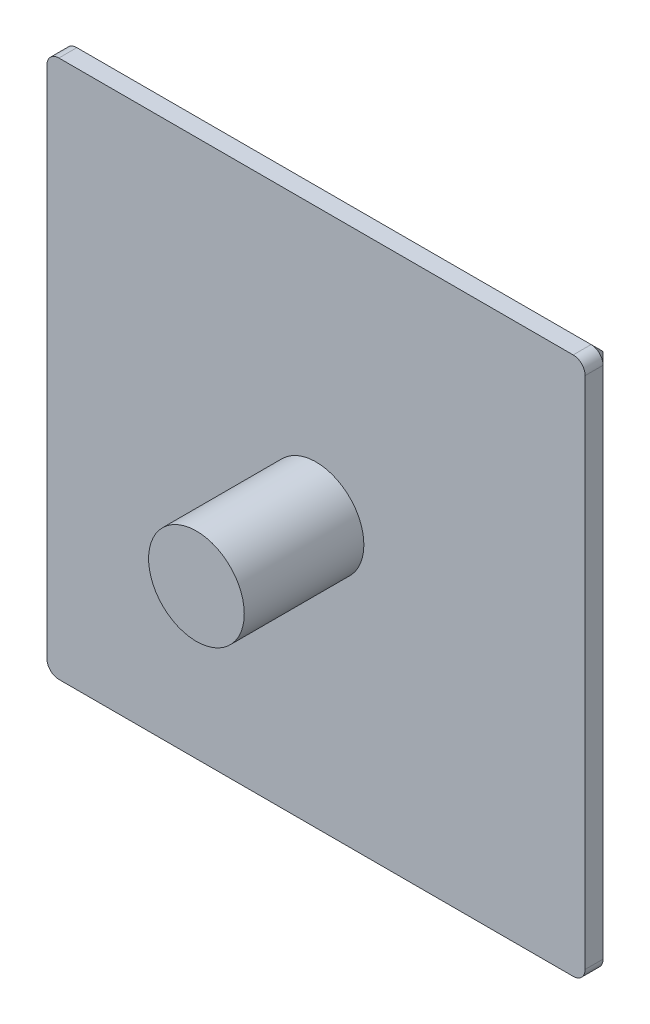
ISO-10303-21;
HEADER;
FILE_DESCRIPTION(('STEP AP214'),'2;1');
FILE_NAME('part.step','',(''),(''),'','','');
FILE_SCHEMA(('AUTOMOTIVE_DESIGN { 1 0 10303 214 1 1 1 1 }'));
ENDSEC;
DATA;
#1=APPLICATION_CONTEXT('core data for automotive mechanical design processes');
#2=APPLICATION_PROTOCOL_DEFINITION('international standard','automotive_design',2000,#1);
#3=PRODUCT_CONTEXT('',#1,'mechanical');
#4=PRODUCT('Part','Part','',(#3));
#5=PRODUCT_RELATED_PRODUCT_CATEGORY('part','',(#4));
#6=PRODUCT_DEFINITION_FORMATION('','',#4);
#7=PRODUCT_DEFINITION_CONTEXT('part definition',#1,'design');
#8=PRODUCT_DEFINITION('design','',#6,#7);
#9=PRODUCT_DEFINITION_SHAPE('','',#8);
#10=(LENGTH_UNIT() NAMED_UNIT(*) SI_UNIT(.MILLI.,.METRE.));
#11=(NAMED_UNIT(*) PLANE_ANGLE_UNIT() SI_UNIT($,.RADIAN.));
#12=(NAMED_UNIT(*) SI_UNIT($,.STERADIAN.) SOLID_ANGLE_UNIT());
#13=UNCERTAINTY_MEASURE_WITH_UNIT(LENGTH_MEASURE(1.E-05),#10,'distance_accuracy_value','');
#14=(GEOMETRIC_REPRESENTATION_CONTEXT(3) GLOBAL_UNCERTAINTY_ASSIGNED_CONTEXT((#13)) GLOBAL_UNIT_ASSIGNED_CONTEXT((#10,
#11,#12)) REPRESENTATION_CONTEXT('',''));
#15=CARTESIAN_POINT('',(0.,0.,0.));
#16=DIRECTION('',(0.,0.,1.));
#17=DIRECTION('',(1.,0.,0.));
#18=AXIS2_PLACEMENT_3D('',#15,#16,#17);
#19=CARTESIAN_POINT('',(-22.5,-22.5,2.5));
#20=DIRECTION('',(1.,0.,0.));
#21=DIRECTION('',(0.,0.,-1.));
#22=AXIS2_PLACEMENT_3D('',#19,#20,#21);
#23=PLANE('',#22);
#24=DIRECTION('',(0.,0.,-1.));
#25=VECTOR('',#24,1.);
#26=CARTESIAN_POINT('',(-22.5,21.5,2.5));
#27=LINE('',#26,#25);
#28=CARTESIAN_POINT('',(-22.5,21.5,2.5));
#29=VERTEX_POINT('',#28);
#30=CARTESIAN_POINT('',(-22.5,21.5,1.));
#31=VERTEX_POINT('',#30);
#32=EDGE_CURVE('E131',#29,#31,#27,.T.);
#33=ORIENTED_EDGE('',*,*,#32,.T.);
#34=DIRECTION('',(0.,-1.,0.));
#35=VECTOR('',#34,1.);
#36=CARTESIAN_POINT('',(-22.5,-22.5,1.));
#37=LINE('',#36,#35);
#38=CARTESIAN_POINT('',(-22.5,-21.5,1.));
#39=VERTEX_POINT('',#38);
#40=EDGE_CURVE('E56',#31,#39,#37,.T.);
#41=ORIENTED_EDGE('',*,*,#40,.T.);
#42=DIRECTION('',(0.,0.,-1.));
#43=VECTOR('',#42,1.);
#44=CARTESIAN_POINT('',(-22.5,-21.5,2.5));
#45=LINE('',#44,#43);
#46=CARTESIAN_POINT('',(-22.5,-21.5,2.5));
#47=VERTEX_POINT('',#46);
#48=EDGE_CURVE('E133',#39,#47,#45,.F.);
#49=ORIENTED_EDGE('',*,*,#48,.T.);
#50=DIRECTION('',(0.,-1.,0.));
#51=VECTOR('',#50,1.);
#52=CARTESIAN_POINT('',(-22.5,-22.5,2.5));
#53=LINE('',#52,#51);
#54=EDGE_CURVE('E118',#29,#47,#53,.T.);
#55=ORIENTED_EDGE('',*,*,#54,.F.);
#56=EDGE_LOOP('',(#33,#41,#49,#55));
#57=FACE_BOUND('',#56,.T.);
#58=ADVANCED_FACE('F32',(#57),#23,.F.);
#59=CARTESIAN_POINT('',(22.5,-22.5,2.5));
#60=DIRECTION('',(0.,1.,0.));
#61=DIRECTION('',(-1.,0.,0.));
#62=AXIS2_PLACEMENT_3D('',#59,#60,#61);
#63=PLANE('',#62);
#64=DIRECTION('',(0.,0.,-1.));
#65=VECTOR('',#64,1.);
#66=CARTESIAN_POINT('',(-21.5,-22.5,2.5));
#67=LINE('',#66,#65);
#68=CARTESIAN_POINT('',(-21.5,-22.5,2.5));
#69=VERTEX_POINT('',#68);
#70=CARTESIAN_POINT('',(-21.5,-22.5,1.));
#71=VERTEX_POINT('',#70);
#72=EDGE_CURVE('E124',#69,#71,#67,.T.);
#73=ORIENTED_EDGE('',*,*,#72,.T.);
#74=DIRECTION('',(1.,0.,0.));
#75=VECTOR('',#74,1.);
#76=CARTESIAN_POINT('',(22.5,-22.5,1.));
#77=LINE('',#76,#75);
#78=CARTESIAN_POINT('',(21.5,-22.5,1.));
#79=VERTEX_POINT('',#78);
#80=EDGE_CURVE('E11',#71,#79,#77,.T.);
#81=ORIENTED_EDGE('',*,*,#80,.T.);
#82=DIRECTION('',(0.,0.,-1.));
#83=VECTOR('',#82,1.);
#84=CARTESIAN_POINT('',(21.5,-22.5,2.5));
#85=LINE('',#84,#83);
#86=CARTESIAN_POINT('',(21.5,-22.5,2.5));
#87=VERTEX_POINT('',#86);
#88=EDGE_CURVE('E127',#79,#87,#85,.F.);
#89=ORIENTED_EDGE('',*,*,#88,.T.);
#90=DIRECTION('',(1.,0.,0.));
#91=VECTOR('',#90,1.);
#92=CARTESIAN_POINT('',(22.5,-22.5,2.5));
#93=LINE('',#92,#91);
#94=EDGE_CURVE('E115',#69,#87,#93,.T.);
#95=ORIENTED_EDGE('',*,*,#94,.F.);
#96=EDGE_LOOP('',(#73,#81,#89,#95));
#97=FACE_BOUND('',#96,.T.);
#98=ADVANCED_FACE('F123',(#97),#63,.F.);
#99=CARTESIAN_POINT('',(22.5,-22.5,2.5));
#100=DIRECTION('',(-1.,0.,0.));
#101=DIRECTION('',(0.,0.,1.));
#102=AXIS2_PLACEMENT_3D('',#99,#100,#101);
#103=PLANE('',#102);
#104=DIRECTION('',(0.,0.,-1.));
#105=VECTOR('',#104,1.);
#106=CARTESIAN_POINT('',(22.5,-21.5,2.5));
#107=LINE('',#106,#105);
#108=CARTESIAN_POINT('',(22.5,-21.5,2.5));
#109=VERTEX_POINT('',#108);
#110=CARTESIAN_POINT('',(22.5,-21.5,1.));
#111=VERTEX_POINT('',#110);
#112=EDGE_CURVE('E146',#109,#111,#107,.T.);
#113=ORIENTED_EDGE('',*,*,#112,.T.);
#114=DIRECTION('',(0.,1.,0.));
#115=VECTOR('',#114,1.);
#116=CARTESIAN_POINT('',(22.5,-22.5,1.));
#117=LINE('',#116,#115);
#118=CARTESIAN_POINT('',(22.5,21.5,1.));
#119=VERTEX_POINT('',#118);
#120=EDGE_CURVE('E157',#111,#119,#117,.T.);
#121=ORIENTED_EDGE('',*,*,#120,.T.);
#122=DIRECTION('',(0.,0.,-1.));
#123=VECTOR('',#122,1.);
#124=CARTESIAN_POINT('',(22.5,21.5,2.5));
#125=LINE('',#124,#123);
#126=CARTESIAN_POINT('',(22.5,21.5,2.5));
#127=VERTEX_POINT('',#126);
#128=EDGE_CURVE('E119',#119,#127,#125,.F.);
#129=ORIENTED_EDGE('',*,*,#128,.T.);
#130=DIRECTION('',(0.,1.,0.));
#131=VECTOR('',#130,1.);
#132=CARTESIAN_POINT('',(22.5,-22.5,2.5));
#133=LINE('',#132,#131);
#134=EDGE_CURVE('E128',#109,#127,#133,.T.);
#135=ORIENTED_EDGE('',*,*,#134,.F.);
#136=EDGE_LOOP('',(#113,#121,#129,#135));
#137=FACE_BOUND('',#136,.T.);
#138=ADVANCED_FACE('F247',(#137),#103,.F.);
#139=CARTESIAN_POINT('',(22.5,22.5,2.5));
#140=DIRECTION('',(0.,-1.,0.));
#141=DIRECTION('',(1.,0.,0.));
#142=AXIS2_PLACEMENT_3D('',#139,#140,#141);
#143=PLANE('',#142);
#144=DIRECTION('',(0.,0.,-1.));
#145=VECTOR('',#144,1.);
#146=CARTESIAN_POINT('',(21.5,22.5,2.5));
#147=LINE('',#146,#145);
#148=CARTESIAN_POINT('',(21.5,22.5,2.5));
#149=VERTEX_POINT('',#148);
#150=CARTESIAN_POINT('',(21.5,22.5,1.));
#151=VERTEX_POINT('',#150);
#152=EDGE_CURVE('E149',#149,#151,#147,.T.);
#153=ORIENTED_EDGE('',*,*,#152,.T.);
#154=DIRECTION('',(-1.,0.,0.));
#155=VECTOR('',#154,1.);
#156=CARTESIAN_POINT('',(22.5,22.5,1.));
#157=LINE('',#156,#155);
#158=CARTESIAN_POINT('',(-21.5,22.5,1.));
#159=VERTEX_POINT('',#158);
#160=EDGE_CURVE('E170',#151,#159,#157,.T.);
#161=ORIENTED_EDGE('',*,*,#160,.T.);
#162=DIRECTION('',(0.,0.,-1.));
#163=VECTOR('',#162,1.);
#164=CARTESIAN_POINT('',(-21.5,22.5,2.5));
#165=LINE('',#164,#163);
#166=CARTESIAN_POINT('',(-21.5,22.5,2.5));
#167=VERTEX_POINT('',#166);
#168=EDGE_CURVE('E152',#159,#167,#165,.F.);
#169=ORIENTED_EDGE('',*,*,#168,.T.);
#170=DIRECTION('',(-1.,0.,0.));
#171=VECTOR('',#170,1.);
#172=CARTESIAN_POINT('',(22.5,22.5,2.5));
#173=LINE('',#172,#171);
#174=EDGE_CURVE('E135',#149,#167,#173,.T.);
#175=ORIENTED_EDGE('',*,*,#174,.F.);
#176=EDGE_LOOP('',(#153,#161,#169,#175));
#177=FACE_BOUND('',#176,.T.);
#178=ADVANCED_FACE('F256',(#177),#143,.F.);
#179=CARTESIAN_POINT('',(0.,0.,2.5));
#180=DIRECTION('',(0.,0.,1.));
#181=DIRECTION('',(1.,0.,0.));
#182=AXIS2_PLACEMENT_3D('',#179,#180,#181);
#183=PLANE('',#182);
#184=CARTESIAN_POINT('',(0.,0.,2.5));
#185=DIRECTION('',(0.,0.,1.));
#186=DIRECTION('',(1.,0.,0.));
#187=AXIS2_PLACEMENT_3D('',#184,#185,#186);
#188=CIRCLE('',#187,4.);
#189=CARTESIAN_POINT('',(4.,0.,2.5));
#190=VERTEX_POINT('',#189);
#191=EDGE_CURVE('E198',#190,#190,#188,.T.);
#192=ORIENTED_EDGE('',*,*,#191,.F.);
#193=EDGE_LOOP('',(#192));
#194=FACE_BOUND('',#193,.T.);
#195=ORIENTED_EDGE('',*,*,#54,.T.);
#196=CARTESIAN_POINT('',(-21.5,-21.5,2.5));
#197=DIRECTION('',(0.,0.,1.));
#198=DIRECTION('',(1.,0.,0.));
#199=AXIS2_PLACEMENT_3D('',#196,#197,#198);
#200=CIRCLE('',#199,1.);
#201=EDGE_CURVE('E112',#47,#69,#200,.T.);
#202=ORIENTED_EDGE('',*,*,#201,.T.);
#203=ORIENTED_EDGE('',*,*,#94,.T.);
#204=CARTESIAN_POINT('',(21.5,-21.5,2.5));
#205=DIRECTION('',(0.,0.,1.));
#206=DIRECTION('',(1.,0.,0.));
#207=AXIS2_PLACEMENT_3D('',#204,#205,#206);
#208=CIRCLE('',#207,1.);
#209=EDGE_CURVE('E120',#87,#109,#208,.T.);
#210=ORIENTED_EDGE('',*,*,#209,.T.);
#211=ORIENTED_EDGE('',*,*,#134,.T.);
#212=CARTESIAN_POINT('',(21.5,21.5,2.5));
#213=DIRECTION('',(0.,0.,1.));
#214=DIRECTION('',(1.,0.,0.));
#215=AXIS2_PLACEMENT_3D('',#212,#213,#214);
#216=CIRCLE('',#215,1.);
#217=EDGE_CURVE('E140',#127,#149,#216,.T.);
#218=ORIENTED_EDGE('',*,*,#217,.T.);
#219=ORIENTED_EDGE('',*,*,#174,.T.);
#220=CARTESIAN_POINT('',(-21.5,21.5,2.5));
#221=DIRECTION('',(0.,0.,1.));
#222=DIRECTION('',(1.,0.,0.));
#223=AXIS2_PLACEMENT_3D('',#220,#221,#222);
#224=CIRCLE('',#223,1.);
#225=EDGE_CURVE('E142',#167,#29,#224,.T.);
#226=ORIENTED_EDGE('',*,*,#225,.T.);
#227=EDGE_LOOP('',(#195,#202,#203,#210,#211,#218,#219,#226));
#228=FACE_BOUND('',#227,.T.);
#229=ADVANCED_FACE('F114',(#194,#228),#183,.T.);
#230=CARTESIAN_POINT('',(0.,0.,0.));
#231=DIRECTION('',(0.,0.,1.));
#232=DIRECTION('',(1.,0.,0.));
#233=AXIS2_PLACEMENT_3D('',#230,#231,#232);
#234=PLANE('',#233);
#235=DIRECTION('',(1.,0.,0.));
#236=VECTOR('',#235,1.);
#237=CARTESIAN_POINT('',(0.,21.5,0.));
#238=LINE('',#237,#236);
#239=CARTESIAN_POINT('',(-21.5,21.5,0.));
#240=VERTEX_POINT('',#239);
#241=CARTESIAN_POINT('',(21.5,21.5,0.));
#242=VERTEX_POINT('',#241);
#243=EDGE_CURVE('E163',#240,#242,#238,.T.);
#244=ORIENTED_EDGE('',*,*,#243,.T.);
#245=DIRECTION('',(0.,-1.,0.));
#246=VECTOR('',#245,1.);
#247=CARTESIAN_POINT('',(21.5,0.,0.));
#248=LINE('',#247,#246);
#249=CARTESIAN_POINT('',(21.5,-21.5,0.));
#250=VERTEX_POINT('',#249);
#251=EDGE_CURVE('E165',#242,#250,#248,.T.);
#252=ORIENTED_EDGE('',*,*,#251,.T.);
#253=DIRECTION('',(-1.,0.,0.));
#254=VECTOR('',#253,1.);
#255=CARTESIAN_POINT('',(0.,-21.5,0.));
#256=LINE('',#255,#254);
#257=CARTESIAN_POINT('',(-21.5,-21.5,0.));
#258=VERTEX_POINT('',#257);
#259=EDGE_CURVE('E159',#250,#258,#256,.T.);
#260=ORIENTED_EDGE('',*,*,#259,.T.);
#261=DIRECTION('',(0.,1.,0.));
#262=VECTOR('',#261,1.);
#263=CARTESIAN_POINT('',(-21.5,0.,0.));
#264=LINE('',#263,#262);
#265=EDGE_CURVE('E161',#258,#240,#264,.T.);
#266=ORIENTED_EDGE('',*,*,#265,.T.);
#267=EDGE_LOOP('',(#244,#252,#260,#266));
#268=FACE_BOUND('',#267,.T.);
#269=ADVANCED_FACE('F263',(#268),#234,.F.);
#270=CARTESIAN_POINT('',(-21.5,-21.5,2.5));
#271=DIRECTION('',(0.,0.,-1.));
#272=DIRECTION('',(-1.,0.,0.));
#273=AXIS2_PLACEMENT_3D('',#270,#271,#272);
#274=CYLINDRICAL_SURFACE('',#273,1.);
#275=ORIENTED_EDGE('',*,*,#48,.F.);
#276=CARTESIAN_POINT('',(-21.5,-21.5,1.));
#277=DIRECTION('',(0.,0.,1.));
#278=DIRECTION('',(1.,0.,0.));
#279=AXIS2_PLACEMENT_3D('',#276,#277,#278);
#280=CIRCLE('',#279,1.);
#281=EDGE_CURVE('E41',#39,#71,#280,.T.);
#282=ORIENTED_EDGE('',*,*,#281,.T.);
#283=ORIENTED_EDGE('',*,*,#72,.F.);
#284=ORIENTED_EDGE('',*,*,#201,.F.);
#285=EDGE_LOOP('',(#275,#282,#283,#284));
#286=FACE_BOUND('',#285,.T.);
#287=ADVANCED_FACE('F130',(#286),#274,.T.);
#288=CARTESIAN_POINT('',(21.5,-21.5,2.5));
#289=DIRECTION('',(0.,0.,-1.));
#290=DIRECTION('',(-1.,0.,0.));
#291=AXIS2_PLACEMENT_3D('',#288,#289,#290);
#292=CYLINDRICAL_SURFACE('',#291,1.);
#293=ORIENTED_EDGE('',*,*,#88,.F.);
#294=CARTESIAN_POINT('',(21.5,-21.5,1.));
#295=DIRECTION('',(0.,0.,1.));
#296=DIRECTION('',(1.,0.,0.));
#297=AXIS2_PLACEMENT_3D('',#294,#295,#296);
#298=CIRCLE('',#297,1.);
#299=EDGE_CURVE('E154',#79,#111,#298,.T.);
#300=ORIENTED_EDGE('',*,*,#299,.T.);
#301=ORIENTED_EDGE('',*,*,#112,.F.);
#302=ORIENTED_EDGE('',*,*,#209,.F.);
#303=EDGE_LOOP('',(#293,#300,#301,#302));
#304=FACE_BOUND('',#303,.T.);
#305=ADVANCED_FACE('F235',(#304),#292,.T.);
#306=CARTESIAN_POINT('',(-21.5,21.5,2.5));
#307=DIRECTION('',(0.,0.,-1.));
#308=DIRECTION('',(-1.,0.,0.));
#309=AXIS2_PLACEMENT_3D('',#306,#307,#308);
#310=CYLINDRICAL_SURFACE('',#309,1.);
#311=ORIENTED_EDGE('',*,*,#168,.F.);
#312=CARTESIAN_POINT('',(-21.5,21.5,1.));
#313=DIRECTION('',(0.,0.,1.));
#314=DIRECTION('',(1.,0.,0.));
#315=AXIS2_PLACEMENT_3D('',#312,#313,#314);
#316=CIRCLE('',#315,1.);
#317=EDGE_CURVE('E172',#159,#31,#316,.T.);
#318=ORIENTED_EDGE('',*,*,#317,.T.);
#319=ORIENTED_EDGE('',*,*,#32,.F.);
#320=ORIENTED_EDGE('',*,*,#225,.F.);
#321=EDGE_LOOP('',(#311,#318,#319,#320));
#322=FACE_BOUND('',#321,.T.);
#323=ADVANCED_FACE('F221',(#322),#310,.T.);
#324=CARTESIAN_POINT('',(21.5,21.5,2.5));
#325=DIRECTION('',(0.,0.,-1.));
#326=DIRECTION('',(-1.,0.,0.));
#327=AXIS2_PLACEMENT_3D('',#324,#325,#326);
#328=CYLINDRICAL_SURFACE('',#327,1.);
#329=ORIENTED_EDGE('',*,*,#128,.F.);
#330=CARTESIAN_POINT('',(21.5,21.5,1.));
#331=DIRECTION('',(0.,0.,1.));
#332=DIRECTION('',(1.,0.,0.));
#333=AXIS2_PLACEMENT_3D('',#330,#331,#332);
#334=CIRCLE('',#333,1.);
#335=EDGE_CURVE('E168',#119,#151,#334,.T.);
#336=ORIENTED_EDGE('',*,*,#335,.T.);
#337=ORIENTED_EDGE('',*,*,#152,.F.);
#338=ORIENTED_EDGE('',*,*,#217,.F.);
#339=EDGE_LOOP('',(#329,#336,#337,#338));
#340=FACE_BOUND('',#339,.T.);
#341=ADVANCED_FACE('F251',(#340),#328,.T.);
#342=CARTESIAN_POINT('',(0.,0.,12.5));
#343=DIRECTION('',(0.,0.,-1.));
#344=DIRECTION('',(-1.,0.,0.));
#345=AXIS2_PLACEMENT_3D('',#342,#343,#344);
#346=CYLINDRICAL_SURFACE('',#345,4.);
#347=CARTESIAN_POINT('',(0.,0.,12.5));
#348=DIRECTION('',(0.,0.,1.));
#349=DIRECTION('',(1.,0.,0.));
#350=AXIS2_PLACEMENT_3D('',#347,#348,#349);
#351=CIRCLE('',#350,4.);
#352=CARTESIAN_POINT('',(4.,0.,12.5));
#353=VERTEX_POINT('',#352);
#354=EDGE_CURVE('E203',#353,#353,#351,.T.);
#355=ORIENTED_EDGE('',*,*,#354,.F.);
#356=EDGE_LOOP('',(#355));
#357=FACE_BOUND('',#356,.T.);
#358=ORIENTED_EDGE('',*,*,#191,.T.);
#359=EDGE_LOOP('',(#358));
#360=FACE_BOUND('',#359,.T.);
#361=ADVANCED_FACE('F283',(#357,#360),#346,.T.);
#362=CARTESIAN_POINT('',(0.,0.,12.5));
#363=DIRECTION('',(0.,0.,1.));
#364=DIRECTION('',(1.,0.,0.));
#365=AXIS2_PLACEMENT_3D('',#362,#363,#364);
#366=PLANE('',#365);
#367=ORIENTED_EDGE('',*,*,#354,.T.);
#368=EDGE_LOOP('',(#367));
#369=FACE_BOUND('',#368,.T.);
#370=ADVANCED_FACE('F299',(#369),#366,.T.);
#371=CARTESIAN_POINT('',(-21.5,21.5,1.));
#372=DIRECTION('',(0.,0.,1.));
#373=DIRECTION('',(1.,0.,0.));
#374=AXIS2_PLACEMENT_3D('',#371,#372,#373);
#375=CONICAL_SURFACE('',#374,1.00000000000001,0.785398163397452);
#376=DIRECTION('',(0.70710678118655,0.,-0.707106781186545));
#377=VECTOR('',#376,1.);
#378=CARTESIAN_POINT('',(-22.5,21.5,1.));
#379=LINE('',#378,#377);
#380=EDGE_CURVE('E191',#31,#240,#379,.T.);
#381=ORIENTED_EDGE('',*,*,#380,.F.);
#382=ORIENTED_EDGE('',*,*,#317,.F.);
#383=DIRECTION('',(0.,0.70710678118655,0.707106781186545));
#384=VECTOR('',#383,1.);
#385=CARTESIAN_POINT('',(-21.5,21.5,0.));
#386=LINE('',#385,#384);
#387=EDGE_CURVE('E36',#240,#159,#386,.T.);
#388=ORIENTED_EDGE('',*,*,#387,.F.);
#389=EDGE_LOOP('',(#381,#382,#388));
#390=FACE_BOUND('',#389,.T.);
#391=ADVANCED_FACE('F34',(#390),#375,.T.);
#392=CARTESIAN_POINT('',(22.5,22.5,1.));
#393=DIRECTION('',(0.,-0.707106781186545,0.70710678118655));
#394=DIRECTION('',(-1.,0.,0.));
#395=AXIS2_PLACEMENT_3D('',#392,#393,#394);
#396=PLANE('',#395);
#397=ORIENTED_EDGE('',*,*,#387,.T.);
#398=ORIENTED_EDGE('',*,*,#160,.F.);
#399=DIRECTION('',(0.,0.70710678118655,0.707106781186545));
#400=VECTOR('',#399,1.);
#401=CARTESIAN_POINT('',(21.5,21.5,0.));
#402=LINE('',#401,#400);
#403=EDGE_CURVE('E189',#242,#151,#402,.T.);
#404=ORIENTED_EDGE('',*,*,#403,.F.);
#405=ORIENTED_EDGE('',*,*,#243,.F.);
#406=EDGE_LOOP('',(#397,#398,#404,#405));
#407=FACE_BOUND('',#406,.T.);
#408=ADVANCED_FACE('F255',(#407),#396,.F.);
#409=CARTESIAN_POINT('',(-22.5,-22.5,1.));
#410=DIRECTION('',(0.707106781186545,0.,0.70710678118655));
#411=DIRECTION('',(0.,-1.,0.));
#412=AXIS2_PLACEMENT_3D('',#409,#410,#411);
#413=PLANE('',#412);
#414=ORIENTED_EDGE('',*,*,#380,.T.);
#415=ORIENTED_EDGE('',*,*,#265,.F.);
#416=DIRECTION('',(0.70710678118655,0.,-0.707106781186545));
#417=VECTOR('',#416,1.);
#418=CARTESIAN_POINT('',(-22.5,-21.5,1.));
#419=LINE('',#418,#417);
#420=EDGE_CURVE('E186',#39,#258,#419,.T.);
#421=ORIENTED_EDGE('',*,*,#420,.F.);
#422=ORIENTED_EDGE('',*,*,#40,.F.);
#423=EDGE_LOOP('',(#414,#415,#421,#422));
#424=FACE_BOUND('',#423,.T.);
#425=ADVANCED_FACE('F225',(#424),#413,.F.);
#426=CARTESIAN_POINT('',(21.5,21.5,1.));
#427=DIRECTION('',(0.,0.,1.));
#428=DIRECTION('',(1.,0.,0.));
#429=AXIS2_PLACEMENT_3D('',#426,#427,#428);
#430=CONICAL_SURFACE('',#429,1.00000000000001,0.785398163397452);
#431=ORIENTED_EDGE('',*,*,#403,.T.);
#432=ORIENTED_EDGE('',*,*,#335,.F.);
#433=DIRECTION('',(0.70710678118655,0.,0.707106781186545));
#434=VECTOR('',#433,1.);
#435=CARTESIAN_POINT('',(21.5,21.5,0.));
#436=LINE('',#435,#434);
#437=EDGE_CURVE('E183',#242,#119,#436,.T.);
#438=ORIENTED_EDGE('',*,*,#437,.F.);
#439=EDGE_LOOP('',(#431,#432,#438));
#440=FACE_BOUND('',#439,.T.);
#441=ADVANCED_FACE('F253',(#440),#430,.T.);
#442=CARTESIAN_POINT('',(-21.5,-21.5,1.));
#443=DIRECTION('',(0.,0.,1.));
#444=DIRECTION('',(1.,0.,0.));
#445=AXIS2_PLACEMENT_3D('',#442,#443,#444);
#446=CONICAL_SURFACE('',#445,1.00000000000001,0.785398163397452);
#447=ORIENTED_EDGE('',*,*,#281,.F.);
#448=ORIENTED_EDGE('',*,*,#420,.T.);
#449=DIRECTION('',(0.,0.70710678118655,-0.707106781186545));
#450=VECTOR('',#449,1.);
#451=CARTESIAN_POINT('',(-21.5,-22.5,1.));
#452=LINE('',#451,#450);
#453=EDGE_CURVE('E180',#71,#258,#452,.T.);
#454=ORIENTED_EDGE('',*,*,#453,.F.);
#455=EDGE_LOOP('',(#447,#448,#454));
#456=FACE_BOUND('',#455,.T.);
#457=ADVANCED_FACE('F227',(#456),#446,.T.);
#458=CARTESIAN_POINT('',(22.5,-22.5,1.));
#459=DIRECTION('',(-0.707106781186545,0.,0.70710678118655));
#460=DIRECTION('',(0.,1.,0.));
#461=AXIS2_PLACEMENT_3D('',#458,#459,#460);
#462=PLANE('',#461);
#463=ORIENTED_EDGE('',*,*,#437,.T.);
#464=ORIENTED_EDGE('',*,*,#120,.F.);
#465=DIRECTION('',(0.70710678118655,0.,0.707106781186545));
#466=VECTOR('',#465,1.);
#467=CARTESIAN_POINT('',(21.5,-21.5,0.));
#468=LINE('',#467,#466);
#469=EDGE_CURVE('E178',#250,#111,#468,.T.);
#470=ORIENTED_EDGE('',*,*,#469,.F.);
#471=ORIENTED_EDGE('',*,*,#251,.F.);
#472=EDGE_LOOP('',(#463,#464,#470,#471));
#473=FACE_BOUND('',#472,.T.);
#474=ADVANCED_FACE('F243',(#473),#462,.F.);
#475=CARTESIAN_POINT('',(22.5,-22.5,1.));
#476=DIRECTION('',(0.,0.707106781186545,0.70710678118655));
#477=DIRECTION('',(1.,0.,0.));
#478=AXIS2_PLACEMENT_3D('',#475,#476,#477);
#479=PLANE('',#478);
#480=ORIENTED_EDGE('',*,*,#453,.T.);
#481=ORIENTED_EDGE('',*,*,#259,.F.);
#482=DIRECTION('',(0.,0.70710678118655,-0.707106781186545));
#483=VECTOR('',#482,1.);
#484=CARTESIAN_POINT('',(21.5,-22.5,1.));
#485=LINE('',#484,#483);
#486=EDGE_CURVE('E176',#79,#250,#485,.T.);
#487=ORIENTED_EDGE('',*,*,#486,.F.);
#488=ORIENTED_EDGE('',*,*,#80,.F.);
#489=EDGE_LOOP('',(#480,#481,#487,#488));
#490=FACE_BOUND('',#489,.T.);
#491=ADVANCED_FACE('F232',(#490),#479,.F.);
#492=CARTESIAN_POINT('',(21.5,-21.5,1.));
#493=DIRECTION('',(0.,0.,1.));
#494=DIRECTION('',(1.,0.,0.));
#495=AXIS2_PLACEMENT_3D('',#492,#493,#494);
#496=CONICAL_SURFACE('',#495,1.00000000000001,0.785398163397452);
#497=ORIENTED_EDGE('',*,*,#469,.T.);
#498=ORIENTED_EDGE('',*,*,#299,.F.);
#499=ORIENTED_EDGE('',*,*,#486,.T.);
#500=EDGE_LOOP('',(#497,#498,#499));
#501=FACE_BOUND('',#500,.T.);
#502=ADVANCED_FACE('F238',(#501),#496,.T.);
#503=CLOSED_SHELL('',(#58,#98,#138,#178,#229,#269,#287,#305,#323,#341,#361,#370,#391,#408,#425,
#441,#457,#474,#491,#502));
#504=MANIFOLD_SOLID_BREP('B2',#503);
#505=ADVANCED_BREP_SHAPE_REPRESENTATION('',(#18,#504),#14);
#506=SHAPE_DEFINITION_REPRESENTATION(#9,#505);
ENDSEC;
END-ISO-10303-21;
